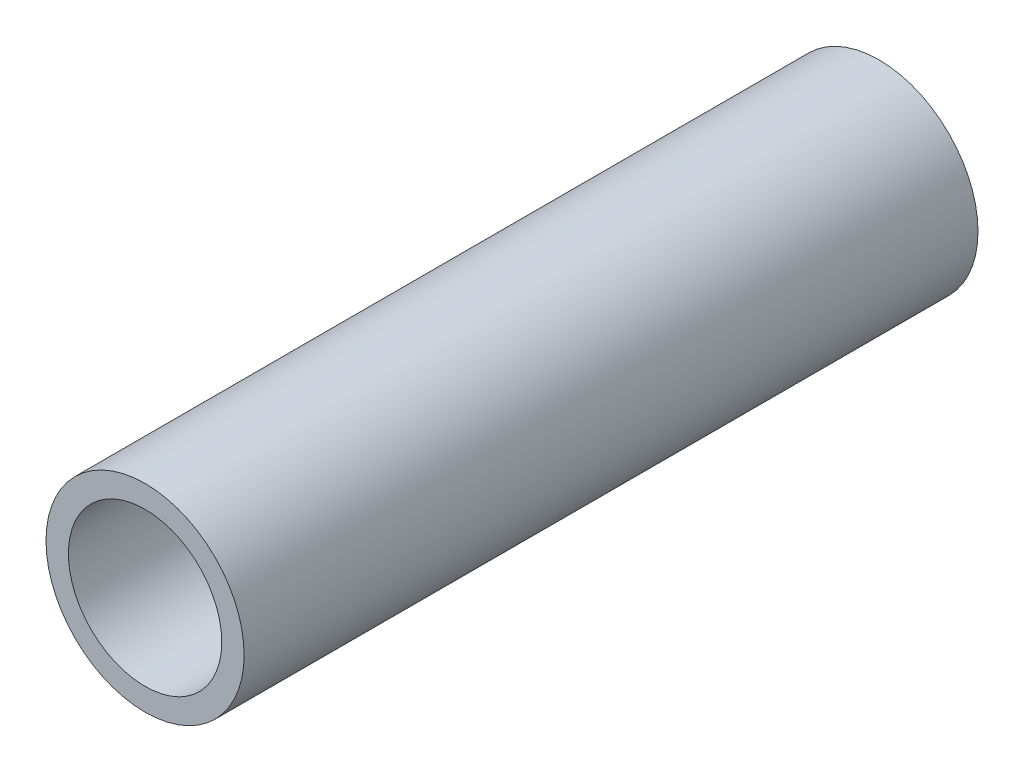
ISO-10303-21;
HEADER;
FILE_DESCRIPTION(('STEP AP214'),'2;1');
FILE_NAME('part.step','',(''),(''),'','','');
FILE_SCHEMA(('AUTOMOTIVE_DESIGN { 1 0 10303 214 1 1 1 1 }'));
ENDSEC;
DATA;
#1=APPLICATION_CONTEXT('core data for automotive mechanical design processes');
#2=APPLICATION_PROTOCOL_DEFINITION('international standard','automotive_design',2000,#1);
#3=PRODUCT_CONTEXT('',#1,'mechanical');
#4=PRODUCT('Part','Part','',(#3));
#5=PRODUCT_RELATED_PRODUCT_CATEGORY('part','',(#4));
#6=PRODUCT_DEFINITION_FORMATION('','',#4);
#7=PRODUCT_DEFINITION_CONTEXT('part definition',#1,'design');
#8=PRODUCT_DEFINITION('design','',#6,#7);
#9=PRODUCT_DEFINITION_SHAPE('','',#8);
#10=(LENGTH_UNIT() NAMED_UNIT(*) SI_UNIT(.MILLI.,.METRE.));
#11=(NAMED_UNIT(*) PLANE_ANGLE_UNIT() SI_UNIT($,.RADIAN.));
#12=(NAMED_UNIT(*) SI_UNIT($,.STERADIAN.) SOLID_ANGLE_UNIT());
#13=UNCERTAINTY_MEASURE_WITH_UNIT(LENGTH_MEASURE(1.E-05),#10,'distance_accuracy_value','');
#14=(GEOMETRIC_REPRESENTATION_CONTEXT(3) GLOBAL_UNCERTAINTY_ASSIGNED_CONTEXT((#13)) GLOBAL_UNIT_ASSIGNED_CONTEXT((#10,
#11,#12)) REPRESENTATION_CONTEXT('',''));
#15=CARTESIAN_POINT('',(0.,0.,0.));
#16=DIRECTION('',(0.,0.,1.));
#17=DIRECTION('',(1.,0.,0.));
#18=AXIS2_PLACEMENT_3D('',#15,#16,#17);
#19=CARTESIAN_POINT('',(0.,0.,40.));
#20=DIRECTION('',(0.,0.,1.));
#21=DIRECTION('',(1.,0.,0.));
#22=AXIS2_PLACEMENT_3D('',#19,#20,#21);
#23=PLANE('',#22);
#24=CARTESIAN_POINT('',(0.,0.,40.));
#25=DIRECTION('',(0.,0.,1.));
#26=DIRECTION('',(1.,0.,0.));
#27=AXIS2_PLACEMENT_3D('',#24,#25,#26);
#28=CIRCLE('',#27,5.4);
#29=CARTESIAN_POINT('',(5.4,0.,40.));
#30=VERTEX_POINT('',#29);
#31=EDGE_CURVE('E10',#30,#30,#28,.T.);
#32=ORIENTED_EDGE('',*,*,#31,.T.);
#33=EDGE_LOOP('',(#32));
#34=FACE_BOUND('',#33,.T.);
#35=CARTESIAN_POINT('',(0.,0.,40.));
#36=DIRECTION('',(0.,0.,1.));
#37=DIRECTION('',(1.,0.,0.));
#38=AXIS2_PLACEMENT_3D('',#35,#36,#37);
#39=CIRCLE('',#38,4.18);
#40=CARTESIAN_POINT('',(4.18,0.,40.));
#41=VERTEX_POINT('',#40);
#42=EDGE_CURVE('E50',#41,#41,#39,.T.);
#43=ORIENTED_EDGE('',*,*,#42,.F.);
#44=EDGE_LOOP('',(#43));
#45=FACE_BOUND('',#44,.T.);
#46=ADVANCED_FACE('F37',(#34,#45),#23,.T.);
#47=CARTESIAN_POINT('',(0.,0.,0.));
#48=DIRECTION('',(0.,0.,1.));
#49=DIRECTION('',(1.,0.,0.));
#50=AXIS2_PLACEMENT_3D('',#47,#48,#49);
#51=PLANE('',#50);
#52=CARTESIAN_POINT('',(0.,0.,0.));
#53=DIRECTION('',(0.,0.,1.));
#54=DIRECTION('',(1.,0.,0.));
#55=AXIS2_PLACEMENT_3D('',#52,#53,#54);
#56=CIRCLE('',#55,5.4);
#57=CARTESIAN_POINT('',(5.4,0.,0.));
#58=VERTEX_POINT('',#57);
#59=EDGE_CURVE('E41',#58,#58,#56,.T.);
#60=ORIENTED_EDGE('',*,*,#59,.F.);
#61=EDGE_LOOP('',(#60));
#62=FACE_BOUND('',#61,.T.);
#63=CARTESIAN_POINT('',(0.,0.,0.));
#64=DIRECTION('',(0.,0.,1.));
#65=DIRECTION('',(1.,0.,0.));
#66=AXIS2_PLACEMENT_3D('',#63,#64,#65);
#67=CIRCLE('',#66,4.18);
#68=CARTESIAN_POINT('',(4.18,0.,0.));
#69=VERTEX_POINT('',#68);
#70=EDGE_CURVE('E52',#69,#69,#67,.T.);
#71=ORIENTED_EDGE('',*,*,#70,.T.);
#72=EDGE_LOOP('',(#71));
#73=FACE_BOUND('',#72,.T.);
#74=ADVANCED_FACE('F86',(#62,#73),#51,.F.);
#75=CARTESIAN_POINT('',(0.,0.,40.));
#76=DIRECTION('',(0.,0.,-1.));
#77=DIRECTION('',(-1.,0.,0.));
#78=AXIS2_PLACEMENT_3D('',#75,#76,#77);
#79=CYLINDRICAL_SURFACE('',#78,5.4);
#80=CARTESIAN_POINT('',(-5.4,0.,17.));
#81=CARTESIAN_POINT('',(-5.40000377358268,-0.155709708248843,16.9999956017704));
#82=CARTESIAN_POINT('',(-5.39320763879922,-0.311394057654437,17.0121758844276));
#83=CARTESIAN_POINT('',(-5.36673516915454,-0.61792331308829,17.0602302337669));
#84=CARTESIAN_POINT('',(-5.34705644394342,-0.768767315545775,17.0961086976304));
#85=CARTESIAN_POINT('',(-5.29682912469933,-1.06090480432502,17.1896721884757));
#86=CARTESIAN_POINT('',(-5.26632048710828,-1.20223115517987,17.2472771049371));
#87=CARTESIAN_POINT('',(-5.1971109249082,-1.47295166111433,17.3821180026466));
#88=CARTESIAN_POINT('',(-5.15840803220894,-1.60234293889907,17.4593587008984));
#89=CARTESIAN_POINT('',(-5.07304777698999,-1.85560338164708,17.6373040189622));
#90=CARTESIAN_POINT('',(-5.02602442483897,-1.97846286638784,17.7392667771318));
#91=CARTESIAN_POINT('',(-4.93026568043437,-2.2063056328557,17.9609992006711));
#92=CARTESIAN_POINT('',(-4.88152860012976,-2.31127065739901,18.0807868216702));
#93=CARTESIAN_POINT('',(-4.78206295706838,-2.51108476684619,18.3491782523558));
#94=CARTESIAN_POINT('',(-4.73163313444088,-2.60383058538314,18.4994721215683));
#95=CARTESIAN_POINT('',(-4.640900287305,-2.7623241916141,18.8164296694098));
#96=CARTESIAN_POINT('',(-4.60058279725259,-2.82811063074917,18.9830694848619));
#97=CARTESIAN_POINT('',(-4.54347962128433,-2.91873863723682,19.2920686678531));
#98=CARTESIAN_POINT('',(-4.52352932102537,-2.94927933628658,19.4321716153672));
#99=CARTESIAN_POINT('',(-4.49671398046002,-2.99001445381968,19.7164827658837));
#100=CARTESIAN_POINT('',(-4.48983604189871,-3.00022892827713,19.8606867796624));
#101=CARTESIAN_POINT('',(-4.49014712382459,-2.99976293343742,20.1491973181154));
#102=CARTESIAN_POINT('',(-4.49735154810001,-2.98905958348395,20.2935037822526));
#103=CARTESIAN_POINT('',(-4.52480635216505,-2.94732540999945,20.5778935114868));
#104=CARTESIAN_POINT('',(-4.54506521494353,-2.91628136853173,20.7179739684502));
#105=CARTESIAN_POINT('',(-4.59599311292294,-2.83533167772622,20.9905187520845));
#106=CARTESIAN_POINT('',(-4.62666446246962,-2.78542183487503,21.1229813779068));
#107=CARTESIAN_POINT('',(-4.69510318900944,-2.66844357047614,21.3780888251516));
#108=CARTESIAN_POINT('',(-4.73287333599936,-2.60136844721767,21.5007297873663));
#109=CARTESIAN_POINT('',(-4.81821032142353,-2.44015511933199,21.7524968293489));
#110=CARTESIAN_POINT('',(-4.86639367288447,-2.34345325748225,21.8797761997753));
#111=CARTESIAN_POINT('',(-4.96303886972262,-2.13117029892803,22.1174408447152));
#112=CARTESIAN_POINT('',(-5.01150090552074,-2.01557430335571,22.2278126527198));
#113=CARTESIAN_POINT('',(-5.10909490819565,-1.75453211292338,22.4397931937706));
#114=CARTESIAN_POINT('',(-5.15779670322181,-1.60724778854607,22.5393791309907));
#115=CARTESIAN_POINT('',(-5.22308664526277,-1.37330747007625,22.6687072998215));
#116=CARTESIAN_POINT('',(-5.24356245548859,-1.29312552837892,22.7084861723615));
#117=CARTESIAN_POINT('',(-5.28134726970941,-1.12891396370821,22.7809331700547));
#118=CARTESIAN_POINT('',(-5.29865816408645,-1.0448866752842,22.8136055420977));
#119=CARTESIAN_POINT('',(-5.32848580057693,-0.879651696308814,22.8693683298404));
#120=CARTESIAN_POINT('',(-5.34125426965979,-0.798662013101176,22.8929714158051));
#121=CARTESIAN_POINT('',(-5.36322484073708,-0.634560572111052,22.9333372804885));
#122=CARTESIAN_POINT('',(-5.37242882326611,-0.551449958016511,22.9501036663283));
#123=CARTESIAN_POINT('',(-5.38699901630289,-0.383810746832693,22.9765553776417));
#124=CARTESIAN_POINT('',(-5.39236711725709,-0.299282869268281,22.9862441912242));
#125=CARTESIAN_POINT('',(-5.39911454666824,-0.129580155025396,22.9984092242993));
#126=CARTESIAN_POINT('',(-5.40049426747498,-0.0444053828105952,23.0008861532483));
#127=CARTESIAN_POINT('',(-5.3986984310642,0.191580881014835,22.9976634010144));
#128=CARTESIAN_POINT('',(-5.3911885041743,0.342346374066467,22.9841834177541));
#129=CARTESIAN_POINT('',(-5.36413556364795,0.63898140090197,22.9350222554685));
#130=CARTESIAN_POINT('',(-5.34459215898558,0.784850775424826,22.8993403549951));
#131=CARTESIAN_POINT('',(-5.29536246358572,1.06754385737641,22.8075532321348));
#132=CARTESIAN_POINT('',(-5.26571358912847,1.20439874238591,22.7515233004749));
#133=CARTESIAN_POINT('',(-5.19870719170712,1.46691137460591,22.6210089026651));
#134=CARTESIAN_POINT('',(-5.1613476063601,1.59256611321301,22.5465194980901));
#135=CARTESIAN_POINT('',(-5.07763412119136,1.84304437073816,22.3725052704394));
#136=CARTESIAN_POINT('',(-5.03075002291723,1.96644647923664,22.2711910706541));
#137=CARTESIAN_POINT('',(-4.93512383069803,2.19544713302843,22.0506883388896));
#138=CARTESIAN_POINT('',(-4.8863797394322,2.30102583943492,21.9314801645679));
#139=CARTESIAN_POINT('',(-4.78676234063523,2.5021434867152,21.6643260146277));
#140=CARTESIAN_POINT('',(-4.73616906442015,2.59560017463837,21.5146948767826));
#141=CARTESIAN_POINT('',(-4.64487915548679,2.75565520480347,21.1989864121292));
#142=CARTESIAN_POINT('',(-4.6041685579531,2.82229153452711,21.0329327641482));
#143=CARTESIAN_POINT('',(-4.54610285328877,2.91466667465892,20.7245396354543));
#144=CARTESIAN_POINT('',(-4.52564846909927,2.9460346329947,20.5844704730862));
#145=CARTESIAN_POINT('',(-4.49778774714188,2.98840710934178,20.3000640352987));
#146=CARTESIAN_POINT('',(-4.49036837629374,2.99943196799111,20.1557311699806));
#147=CARTESIAN_POINT('',(-4.48963754996692,3.0005258289179,19.866773891413));
#148=CARTESIAN_POINT('',(-4.49634365772735,2.99056874280475,19.7221493388453));
#149=CARTESIAN_POINT('',(-4.52291531578749,2.95021971812841,19.4369984176844));
#150=CARTESIAN_POINT('',(-4.54278926914016,2.91981473056268,19.2964747258768));
#151=CARTESIAN_POINT('',(-4.59300641257908,2.84015379845477,19.023417361494));
#152=CARTESIAN_POINT('',(-4.62331794556458,2.79095480720078,18.8908609359792));
#153=CARTESIAN_POINT('',(-4.69113524985242,2.67539330425842,18.6354700597759));
#154=CARTESIAN_POINT('',(-4.72864379102717,2.60902418096059,18.5126393779755));
#155=CARTESIAN_POINT('',(-4.81348306793496,2.44943115058074,18.2605252489084));
#156=CARTESIAN_POINT('',(-4.86144218124626,2.35366755006541,18.1330587044042));
#157=CARTESIAN_POINT('',(-4.95780128112838,2.14327117239822,17.8948458583581));
#158=CARTESIAN_POINT('',(-5.00620159375991,2.02862315243215,17.7841132033916));
#159=CARTESIAN_POINT('',(-5.10396146118016,1.76937439496043,17.5709448225582));
#160=CARTESIAN_POINT('',(-5.15289624323142,1.62289791509761,17.4705732250568));
#161=CARTESIAN_POINT('',(-5.24062389262411,1.31218969639568,17.2963339222307));
#162=CARTESIAN_POINT('',(-5.2794241533726,1.14797102530073,17.2224468809725));
#163=CARTESIAN_POINT('',(-5.33944089861671,0.821787873128469,17.1100742743935));
#164=CARTESIAN_POINT('',(-5.3619276737244,0.660955932617909,17.0689968222348));
#165=CARTESIAN_POINT('',(-5.39219944598484,0.333403162743033,17.0139726663147));
#166=CARTESIAN_POINT('',(-5.39999596038439,0.166687051164936,17.0000047082994));
#167=CARTESIAN_POINT('',(-5.4,0.,17.));
#168=B_SPLINE_CURVE_WITH_KNOTS('',3,(#80,#81,#82,#83,#84,#85,#86,#87,#88,#89,#90,#91,#92,#93,
#94,#95,#96,#97,#98,#99,#100,#101,#102,#103,#104,#105,#106,#107,#108,#109,#110,#111,#112,#113,
#114,#115,#116,#117,#118,#119,#120,#121,#122,#123,#124,#125,#126,#127,#128,#129,#130,#131,#132,
#133,#134,#135,#136,#137,#138,#139,#140,#141,#142,#143,#144,#145,#146,#147,#148,#149,#150,#151,
#152,#153,#154,#155,#156,#157,#158,#159,#160,#161,#162,#163,#164,#165,#166,#167),.UNSPECIFIED.,
.T.,.F.,(4,2,2,2,2,2,2,2,2,2,2,2,2,2,2,2,2,2,2,2,2,2,2,2,2,2,2,2,2,2,2,2,2,2,2,2,2,2,2,2,2,2,2,
4),(0.,0.466482661088802,0.933051902042409,1.39791734973657,1.86289457539064,2.36020553940684,
2.85802089719843,3.40628720562082,3.95376469572423,4.38619411976863,4.81819665183483,
5.2506719880401,5.68342863761979,6.11628153749707,6.54930369137271,7.0481304533116,
7.54735247708022,8.09718570008407,8.3723109657905,8.64727136038113,8.90287288499494,
9.15833937628972,9.41367987844171,9.66899526107193,10.1212385587308,10.5734965527381,
11.0240978965375,11.4748199191766,11.9720122386341,12.4697543756741,13.0176291426713,
13.5647251636269,13.9977997858929,14.4304411508054,14.8636207678419,15.2970770847865,
15.7292301457641,16.1615498619005,16.6590171828102,17.156888026746,17.7065940426788,
18.2558979060237,18.7556589997642,19.2550281147085),.UNSPECIFIED.);
#169=CARTESIAN_POINT('',(-5.4,0.,17.));
#170=VERTEX_POINT('',#169);
#171=EDGE_CURVE('E56',#170,#170,#168,.T.);
#172=ORIENTED_EDGE('',*,*,#171,.F.);
#173=EDGE_LOOP('',(#172));
#174=FACE_BOUND('',#173,.T.);
#175=ORIENTED_EDGE('',*,*,#31,.F.);
#176=EDGE_LOOP('',(#175));
#177=FACE_BOUND('',#176,.T.);
#178=ORIENTED_EDGE('',*,*,#59,.T.);
#179=EDGE_LOOP('',(#178));
#180=FACE_BOUND('',#179,.T.);
#181=ADVANCED_FACE('F39',(#174,#177,#180),#79,.T.);
#182=CARTESIAN_POINT('',(0.,0.,40.));
#183=DIRECTION('',(0.,0.,-1.));
#184=DIRECTION('',(-1.,0.,0.));
#185=AXIS2_PLACEMENT_3D('',#182,#183,#184);
#186=CYLINDRICAL_SURFACE('',#185,4.18);
#187=CARTESIAN_POINT('',(-4.18,0.,17.));
#188=CARTESIAN_POINT('',(-4.17999971924563,-0.0741474017739678,17.0000003461529));
#189=CARTESIAN_POINT('',(-4.17802123826908,-0.148293704860887,17.0027547766343));
#190=CARTESIAN_POINT('',(-4.17016535679311,-0.295981643252385,17.0137162124995));
#191=CARTESIAN_POINT('',(-4.16428652629851,-0.369523046765727,17.0219252177098));
#192=CARTESIAN_POINT('',(-4.14097716263474,-0.5883263766524,17.0545720352524));
#193=CARTESIAN_POINT('',(-4.11787342695801,-0.731894190602829,17.0870299449791));
#194=CARTESIAN_POINT('',(-4.05876153776586,-1.00943873283394,17.1712142720973));
#195=CARTESIAN_POINT('',(-4.02281788240496,-1.14345945354579,17.2228444327572));
#196=CARTESIAN_POINT('',(-3.94079498975497,-1.40025240582973,17.3430475467455));
#197=CARTESIAN_POINT('',(-3.89471435311411,-1.52302308108016,17.4116228394128));
#198=CARTESIAN_POINT('',(-3.79099482958486,-1.76629390037165,17.5703542421043));
#199=CARTESIAN_POINT('',(-3.7326891715671,-1.88559688154916,17.661896548428));
#200=CARTESIAN_POINT('',(-3.61161271947555,-2.10825210779678,17.8604734592961));
#201=CARTESIAN_POINT('',(-3.54883530094735,-2.21157993802577,17.9675313018485));
#202=CARTESIAN_POINT('',(-3.44886139449981,-2.36269249563111,18.149211774541));
#203=CARTESIAN_POINT('',(-3.41164444988689,-2.41597610431691,18.2193187388517));
#204=CARTESIAN_POINT('',(-3.33825807551938,-2.51640829923186,18.3643112429256));
#205=CARTESIAN_POINT('',(-3.30208893669309,-2.56355519402789,18.4391980917047));
#206=CARTESIAN_POINT('',(-3.19695185014023,-2.69525861674167,18.6707001448493));
#207=CARTESIAN_POINT('',(-3.13115174235479,-2.77036932821006,18.834504995921));
#208=CARTESIAN_POINT('',(-3.03792632386173,-2.87168044475942,19.1232493963932));
#209=CARTESIAN_POINT('',(-3.00497218435693,-2.90584277354453,19.2436307222635));
#210=CARTESIAN_POINT('',(-2.95255937226424,-2.95908840069663,19.4904377669561));
#211=CARTESIAN_POINT('',(-2.93307177038779,-2.97820403527306,19.6168499012557));
#212=CARTESIAN_POINT('',(-2.91067418121732,-3.00010958336909,19.8734770429087));
#213=CARTESIAN_POINT('',(-2.90787543304072,-3.00278995139007,20.00371176626));
#214=CARTESIAN_POINT('',(-2.91969365299934,-2.99129367471145,20.262674292401));
#215=CARTESIAN_POINT('',(-2.93432463760248,-2.97710346321668,20.3914007982166));
#216=CARTESIAN_POINT('',(-2.98115764020551,-2.9302374045589,20.6591153161355));
#217=CARTESIAN_POINT('',(-3.0153246566157,-2.89547555070845,20.7973790255011));
#218=CARTESIAN_POINT('',(-3.09657877514869,-2.80840351121332,21.0642772402467));
#219=CARTESIAN_POINT('',(-3.1436947870793,-2.75605400065848,21.1928893698514));
#220=CARTESIAN_POINT('',(-3.26136902666832,-2.61659433262526,21.4785416039437));
#221=CARTESIAN_POINT('',(-3.33462472907422,-2.52372582944204,21.631676987454));
#222=CARTESIAN_POINT('',(-3.44650971933628,-2.36604609979854,21.8465431779641));
#223=CARTESIAN_POINT('',(-3.48417364100427,-2.31036402261791,21.9157488908464));
#224=CARTESIAN_POINT('',(-3.5592082767019,-2.19300928664729,22.0490498226191));
#225=CARTESIAN_POINT('',(-3.5965789773599,-2.13133635635534,22.1131448096546));
#226=CARTESIAN_POINT('',(-3.70760321940982,-1.93611793066356,22.2986622104127));
#227=CARTESIAN_POINT('',(-3.77941496465644,-1.79338619215566,22.4119296482868));
#228=CARTESIAN_POINT('',(-3.87767287921754,-1.56302715621585,22.5622942274473));
#229=CARTESIAN_POINT('',(-3.9088366907349,-1.48357100768559,22.6091425281889));
#230=CARTESIAN_POINT('',(-3.96721120609974,-1.31954681589271,22.6958108617029));
#231=CARTESIAN_POINT('',(-3.99442339811674,-1.23498071410452,22.7356335415264));
#232=CARTESIAN_POINT('',(-4.05613735769635,-1.01889987438803,22.8251304369675));
#233=CARTESIAN_POINT('',(-4.0877412803509,-0.88456651499567,22.8701667111704));
#234=CARTESIAN_POINT('',(-4.13782476546456,-0.608639182537197,22.9410583551166));
#235=CARTESIAN_POINT('',(-4.15631390558306,-0.467050589127109,22.966927722971));
#236=CARTESIAN_POINT('',(-4.17861105189642,-0.179962581515793,22.9980847723184));
#237=CARTESIAN_POINT('',(-4.18237068583139,-0.0344518592159835,23.003304640613));
#238=CARTESIAN_POINT('',(-4.17470933627559,0.255389645354543,22.9926261875058));
#239=CARTESIAN_POINT('',(-4.16328697382913,0.399720319245332,22.9767259477996));
#240=CARTESIAN_POINT('',(-4.12725741016637,0.675696402681681,22.9261146972697));
#241=CARTESIAN_POINT('',(-4.10333585413811,0.807615508141204,22.8923809103542));
#242=CARTESIAN_POINT('',(-4.04458563786475,1.06347384520786,22.8084106696887));
#243=CARTESIAN_POINT('',(-4.00975475088075,1.18741144145123,22.7581708467355));
#244=CARTESIAN_POINT('',(-3.92799427301184,1.43591953761746,22.6379643202752));
#245=CARTESIAN_POINT('',(-3.88026363350459,1.55956407693643,22.5666395825551));
#246=CARTESIAN_POINT('',(-3.77778781690173,1.7936206818523,22.4089158654483));
#247=CARTESIAN_POINT('',(-3.72303740779771,1.90402275749852,22.3225056249119));
#248=CARTESIAN_POINT('',(-3.59954735827653,2.12956174007393,22.1194354614796));
#249=CARTESIAN_POINT('',(-3.53007291431118,2.24191728378233,22.0001318914282));
#250=CARTESIAN_POINT('',(-3.39179988767742,2.44607555943022,21.7445607697663));
#251=CARTESIAN_POINT('',(-3.32300173893358,2.53786582670859,21.6082830074887));
#252=CARTESIAN_POINT('',(-3.20284436355277,2.68737682766248,21.3408574697852));
#253=CARTESIAN_POINT('',(-3.15040765394593,2.74812069664285,21.2118925985609));
#254=CARTESIAN_POINT('',(-3.05711313870705,2.85154764399558,20.9430354351622));
#255=CARTESIAN_POINT('',(-3.01623094647084,2.89426885581101,20.8031669645242));
#256=CARTESIAN_POINT('',(-2.95872128331949,2.95291962368392,20.5426457906608));
#257=CARTESIAN_POINT('',(-2.93892958465162,2.9724358069203,20.4235187127957));
#258=CARTESIAN_POINT('',(-2.91398691542702,2.99689986687606,20.1823127056669));
#259=CARTESIAN_POINT('',(-2.90881840906938,3.00186519290967,20.0602374891533));
#260=CARTESIAN_POINT('',(-2.91395990783875,2.99687239651324,19.8166879770013));
#261=CARTESIAN_POINT('',(-2.92427649735115,2.98690792581863,19.6952139590355));
#262=CARTESIAN_POINT('',(-2.95872066481123,2.95278434842588,19.4562250069967));
#263=CARTESIAN_POINT('',(-2.9828697818796,2.928603102727,19.3387165507226));
#264=CARTESIAN_POINT('',(-3.05150152652909,2.85725416802238,19.0721346510555));
#265=CARTESIAN_POINT('',(-3.10006624572899,2.80513129482419,18.9254610890136));
#266=CARTESIAN_POINT('',(-3.20800079553223,2.68102310997797,18.6451130262389));
#267=CARTESIAN_POINT('',(-3.26738860735087,2.60900464000384,18.5114607344135));
#268=CARTESIAN_POINT('',(-3.3921623648768,2.44470585893377,18.2543427634633));
#269=CARTESIAN_POINT('',(-3.4576686846037,2.35192079373797,18.1312604644609));
#270=CARTESIAN_POINT('',(-3.58774912985078,2.14826673728596,17.9003252211516));
#271=CARTESIAN_POINT('',(-3.65232292244314,2.03739145316606,17.792477600825));
#272=CARTESIAN_POINT('',(-3.7505162554266,1.84726382752076,17.6343980763308));
#273=CARTESIAN_POINT('',(-3.78602352765821,1.77354546165013,17.578601071968));
#274=CARTESIAN_POINT('',(-3.85407526238725,1.62034470875892,17.4735196330939));
#275=CARTESIAN_POINT('',(-3.88662117317596,1.54086517385452,17.4242320097046));
#276=CARTESIAN_POINT('',(-3.94780669368001,1.37655492119836,17.3328050866174));
#277=CARTESIAN_POINT('',(-3.97644943675446,1.29172857669705,17.290660046341));
#278=CARTESIAN_POINT('',(-4.02895796040092,1.117223978298,17.2141650161575));
#279=CARTESIAN_POINT('',(-4.05282541711301,1.0275474409223,17.179812290556));
#280=CARTESIAN_POINT('',(-4.09095381430199,0.861573412442226,17.1253165365405));
#281=CARTESIAN_POINT('',(-4.10617844403491,0.785973799420099,17.1037136559526));
#282=CARTESIAN_POINT('',(-4.13257836552702,0.632647444922187,17.0664052331884));
#283=CARTESIAN_POINT('',(-4.14375457593256,0.554921190323722,17.0506983530929));
#284=CARTESIAN_POINT('',(-4.16175297705978,0.398044865399723,17.0254637265181));
#285=CARTESIAN_POINT('',(-4.16857912737057,0.318896157526796,17.0159303605447));
#286=CARTESIAN_POINT('',(-4.17770268743581,0.15983118436478,17.0031984544056));
#287=CARTESIAN_POINT('',(-4.18000030259284,0.0799149540537411,16.9999996269216));
#288=CARTESIAN_POINT('',(-4.18,0.,17.));
#289=B_SPLINE_CURVE_WITH_KNOTS('',3,(#187,#188,#189,#190,#191,#192,#193,#194,#195,#196,#197,
#198,#199,#200,#201,#202,#203,#204,#205,#206,#207,#208,#209,#210,#211,#212,#213,#214,#215,#216,
#217,#218,#219,#220,#221,#222,#223,#224,#225,#226,#227,#228,#229,#230,#231,#232,#233,#234,#235,
#236,#237,#238,#239,#240,#241,#242,#243,#244,#245,#246,#247,#248,#249,#250,#251,#252,#253,#254,
#255,#256,#257,#258,#259,#260,#261,#262,#263,#264,#265,#266,#267,#268,#269,#270,#271,#272,#273,
#274,#275,#276,#277,#278,#279,#280,#281,#282,#283,#284,#285,#286,#287,#288),.UNSPECIFIED.,.T.,
.F.,(4,2,2,2,2,2,2,2,2,2,2,2,2,2,2,2,2,2,2,2,2,2,2,2,2,2,2,2,2,2,2,2,2,2,2,2,2,2,2,2,2,2,2,2,2,
2,2,2,2,2,4),(0.,0.222355160882334,0.444791889493629,0.889290565756115,1.33158710575228,
1.77394474059078,2.25608501132076,2.73895500480305,3.02544905292323,3.31202189956542,
3.88369305225151,4.27052570758314,4.65652475021079,5.04509380872265,5.43397555385723,
5.87139006523144,6.30978919047486,6.88709713240652,7.17628035500404,7.46547668933679,
8.04943465321982,8.34114437534367,8.63274395385619,9.06626112718483,9.49946137824501,
9.93408308881681,10.3687442780592,10.7817377239191,11.1948155222057,11.6446684108507,
12.0948585565769,12.626807142264,13.1590772762001,13.6132228548273,14.0664026455404,
14.4318028346196,14.7967646579699,15.1618817099456,15.5275688502509,16.0140888699042,
16.5014246749838,17.0022225617963,17.5031950290447,17.7999462634523,18.096551578964,
18.3929173669994,18.6891789465336,18.9291140046045,19.168994583698,19.4086565013633,
19.6483075483372),.UNSPECIFIED.);
#290=CARTESIAN_POINT('',(-4.18,0.,17.));
#291=VERTEX_POINT('',#290);
#292=EDGE_CURVE('E68',#291,#291,#289,.T.);
#293=ORIENTED_EDGE('',*,*,#292,.T.);
#294=EDGE_LOOP('',(#293));
#295=FACE_BOUND('',#294,.T.);
#296=ORIENTED_EDGE('',*,*,#42,.T.);
#297=EDGE_LOOP('',(#296));
#298=FACE_BOUND('',#297,.T.);
#299=ORIENTED_EDGE('',*,*,#70,.F.);
#300=EDGE_LOOP('',(#299));
#301=FACE_BOUND('',#300,.T.);
#302=ADVANCED_FACE('F79',(#295,#298,#301),#186,.F.);
#303=CARTESIAN_POINT('',(-5.401,0.,20.));
#304=DIRECTION('',(1.,0.,0.));
#305=DIRECTION('',(0.,0.,-1.));
#306=AXIS2_PLACEMENT_3D('',#303,#304,#305);
#307=CYLINDRICAL_SURFACE('',#306,3.);
#308=ORIENTED_EDGE('',*,*,#292,.F.);
#309=EDGE_LOOP('',(#308));
#310=FACE_BOUND('',#309,.T.);
#311=ORIENTED_EDGE('',*,*,#171,.T.);
#312=EDGE_LOOP('',(#311));
#313=FACE_BOUND('',#312,.T.);
#314=ADVANCED_FACE('F73',(#310,#313),#307,.F.);
#315=CLOSED_SHELL('',(#46,#74,#181,#302,#314));
#316=MANIFOLD_SOLID_BREP('B2',#315);
#317=ADVANCED_BREP_SHAPE_REPRESENTATION('',(#18,#316),#14);
#318=SHAPE_DEFINITION_REPRESENTATION(#9,#317);
ENDSEC;
END-ISO-10303-21;
